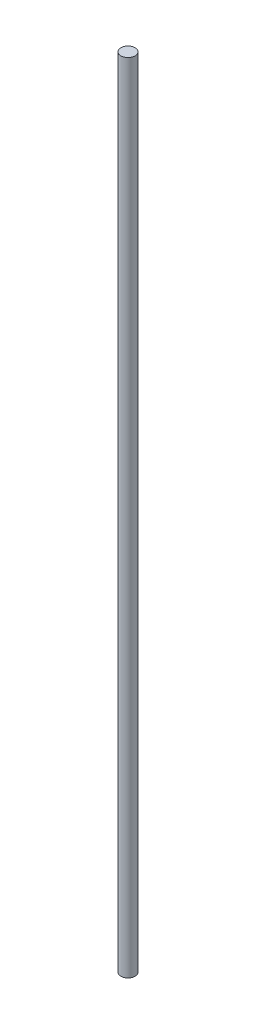
ISO-10303-21;
HEADER;
FILE_DESCRIPTION(('STEP AP214'),'2;1');
FILE_NAME('part.step','',(''),(''),'','','');
FILE_SCHEMA(('AUTOMOTIVE_DESIGN { 1 0 10303 214 1 1 1 1 }'));
ENDSEC;
DATA;
#1=APPLICATION_CONTEXT('core data for automotive mechanical design processes');
#2=APPLICATION_PROTOCOL_DEFINITION('international standard','automotive_design',2000,#1);
#3=PRODUCT_CONTEXT('',#1,'mechanical');
#4=PRODUCT('Part','Part','',(#3));
#5=PRODUCT_RELATED_PRODUCT_CATEGORY('part','',(#4));
#6=PRODUCT_DEFINITION_FORMATION('','',#4);
#7=PRODUCT_DEFINITION_CONTEXT('part definition',#1,'design');
#8=PRODUCT_DEFINITION('design','',#6,#7);
#9=PRODUCT_DEFINITION_SHAPE('','',#8);
#10=(LENGTH_UNIT() NAMED_UNIT(*) SI_UNIT(.MILLI.,.METRE.));
#11=(NAMED_UNIT(*) PLANE_ANGLE_UNIT() SI_UNIT($,.RADIAN.));
#12=(NAMED_UNIT(*) SI_UNIT($,.STERADIAN.) SOLID_ANGLE_UNIT());
#13=UNCERTAINTY_MEASURE_WITH_UNIT(LENGTH_MEASURE(1.E-05),#10,'distance_accuracy_value','');
#14=(GEOMETRIC_REPRESENTATION_CONTEXT(3) GLOBAL_UNCERTAINTY_ASSIGNED_CONTEXT((#13)) GLOBAL_UNIT_ASSIGNED_CONTEXT((#10,
#11,#12)) REPRESENTATION_CONTEXT('',''));
#15=CARTESIAN_POINT('',(0.,0.,0.));
#16=DIRECTION('',(0.,0.,1.));
#17=DIRECTION('',(1.,0.,0.));
#18=AXIS2_PLACEMENT_3D('',#15,#16,#17);
#19=CARTESIAN_POINT('',(0.,450.,0.));
#20=DIRECTION('',(0.,1.,0.));
#21=DIRECTION('',(0.,0.,1.));
#22=AXIS2_PLACEMENT_3D('',#19,#20,#21);
#23=PLANE('',#22);
#24=CARTESIAN_POINT('',(0.,450.,0.));
#25=DIRECTION('',(0.,-1.,0.));
#26=DIRECTION('',(0.,0.,-1.));
#27=AXIS2_PLACEMENT_3D('',#24,#25,#26);
#28=CIRCLE('',#27,4.);
#29=CARTESIAN_POINT('',(0.,450.,-4.));
#30=VERTEX_POINT('',#29);
#31=EDGE_CURVE('E10',#30,#30,#28,.T.);
#32=ORIENTED_EDGE('',*,*,#31,.F.);
#33=EDGE_LOOP('',(#32));
#34=FACE_BOUND('',#33,.T.);
#35=ADVANCED_FACE('F31',(#34),#23,.T.);
#36=CARTESIAN_POINT('',(0.,0.,0.));
#37=DIRECTION('',(0.,-1.,0.));
#38=DIRECTION('',(0.,0.,-1.));
#39=AXIS2_PLACEMENT_3D('',#36,#37,#38);
#40=CYLINDRICAL_SURFACE('',#39,4.);
#41=ORIENTED_EDGE('',*,*,#31,.T.);
#42=EDGE_LOOP('',(#41));
#43=FACE_BOUND('',#42,.T.);
#44=CARTESIAN_POINT('',(0.,0.,0.));
#45=DIRECTION('',(0.,-1.,0.));
#46=DIRECTION('',(0.,0.,-1.));
#47=AXIS2_PLACEMENT_3D('',#44,#45,#46);
#48=CIRCLE('',#47,4.);
#49=CARTESIAN_POINT('',(0.,0.,-4.));
#50=VERTEX_POINT('',#49);
#51=EDGE_CURVE('E37',#50,#50,#48,.T.);
#52=ORIENTED_EDGE('',*,*,#51,.F.);
#53=EDGE_LOOP('',(#52));
#54=FACE_BOUND('',#53,.T.);
#55=ADVANCED_FACE('F45',(#43,#54),#40,.T.);
#56=CARTESIAN_POINT('',(0.,0.,0.));
#57=DIRECTION('',(0.,-1.,0.));
#58=DIRECTION('',(0.,0.,-1.));
#59=AXIS2_PLACEMENT_3D('',#56,#57,#58);
#60=PLANE('',#59);
#61=ORIENTED_EDGE('',*,*,#51,.T.);
#62=EDGE_LOOP('',(#61));
#63=FACE_BOUND('',#62,.T.);
#64=ADVANCED_FACE('F43',(#63),#60,.T.);
#65=CLOSED_SHELL('',(#35,#55,#64));
#66=MANIFOLD_SOLID_BREP('B2',#65);
#67=ADVANCED_BREP_SHAPE_REPRESENTATION('',(#18,#66),#14);
#68=SHAPE_DEFINITION_REPRESENTATION(#9,#67);
ENDSEC;
END-ISO-10303-21;
